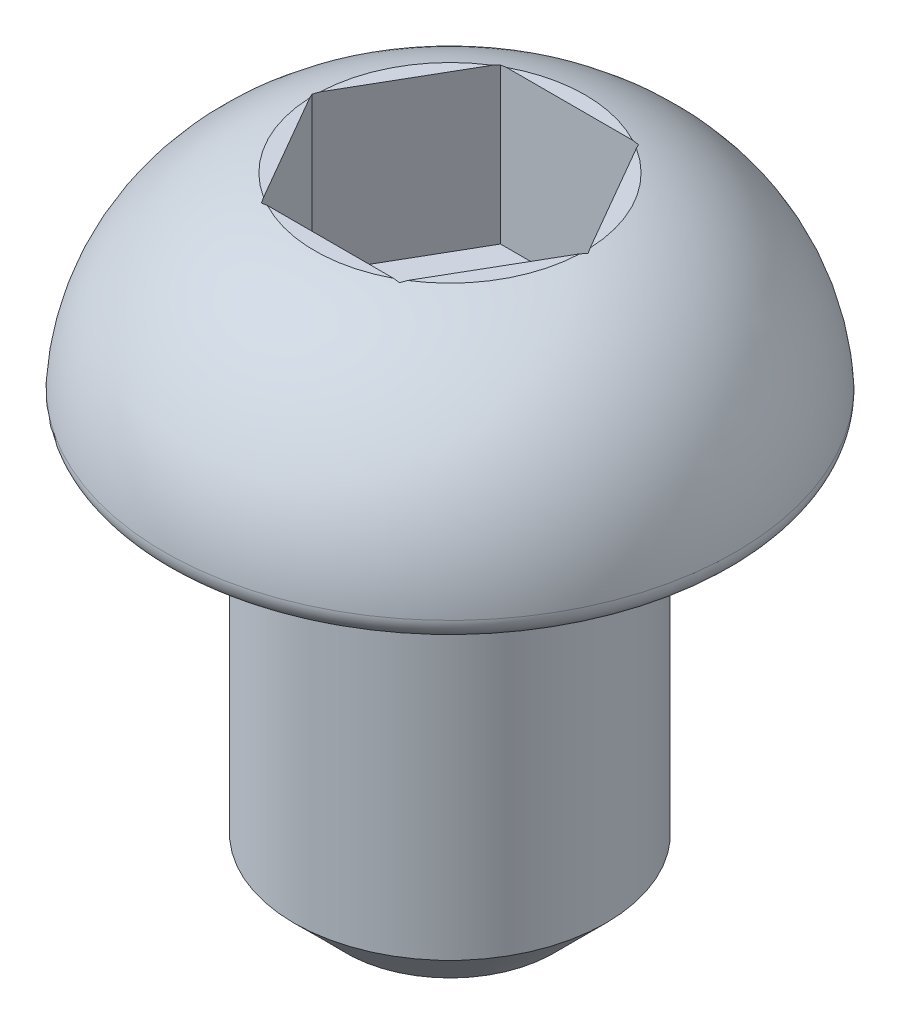
ISO-10303-21;
HEADER;
FILE_DESCRIPTION(('STEP AP214'),'2;1');
FILE_NAME('part.step','',(''),(''),'','','');
FILE_SCHEMA(('AUTOMOTIVE_DESIGN { 1 0 10303 214 1 1 1 1 }'));
ENDSEC;
DATA;
#1=APPLICATION_CONTEXT('core data for automotive mechanical design processes');
#2=APPLICATION_PROTOCOL_DEFINITION('international standard','automotive_design',2000,#1);
#3=PRODUCT_CONTEXT('',#1,'mechanical');
#4=PRODUCT('Part','Part','',(#3));
#5=PRODUCT_RELATED_PRODUCT_CATEGORY('part','',(#4));
#6=PRODUCT_DEFINITION_FORMATION('','',#4);
#7=PRODUCT_DEFINITION_CONTEXT('part definition',#1,'design');
#8=PRODUCT_DEFINITION('design','',#6,#7);
#9=PRODUCT_DEFINITION_SHAPE('','',#8);
#10=(LENGTH_UNIT() NAMED_UNIT(*) SI_UNIT(.MILLI.,.METRE.));
#11=(NAMED_UNIT(*) PLANE_ANGLE_UNIT() SI_UNIT($,.RADIAN.));
#12=(NAMED_UNIT(*) SI_UNIT($,.STERADIAN.) SOLID_ANGLE_UNIT());
#13=UNCERTAINTY_MEASURE_WITH_UNIT(LENGTH_MEASURE(1.E-05),#10,'distance_accuracy_value','');
#14=(GEOMETRIC_REPRESENTATION_CONTEXT(3) GLOBAL_UNCERTAINTY_ASSIGNED_CONTEXT((#13)) GLOBAL_UNIT_ASSIGNED_CONTEXT((#10,
#11,#12)) REPRESENTATION_CONTEXT('',''));
#15=CARTESIAN_POINT('',(0.,0.,0.));
#16=DIRECTION('',(0.,0.,1.));
#17=DIRECTION('',(1.,0.,0.));
#18=AXIS2_PLACEMENT_3D('',#15,#16,#17);
#19=CARTESIAN_POINT('',(0.,0.,0.));
#20=DIRECTION('',(0.,-1.,0.));
#21=DIRECTION('',(0.,0.,-1.));
#22=AXIS2_PLACEMENT_3D('',#19,#20,#21);
#23=PLANE('',#22);
#24=CARTESIAN_POINT('',(0.,0.,0.));
#25=DIRECTION('',(0.,-1.,0.));
#26=DIRECTION('',(0.,0.,-1.));
#27=AXIS2_PLACEMENT_3D('',#24,#25,#26);
#28=CIRCLE('',#27,2.54724235554234);
#29=CARTESIAN_POINT('',(0.,0.,-2.54724235554234));
#30=VERTEX_POINT('',#29);
#31=EDGE_CURVE('E188',#30,#30,#28,.T.);
#32=ORIENTED_EDGE('',*,*,#31,.T.);
#33=EDGE_LOOP('',(#32));
#34=FACE_BOUND('',#33,.T.);
#35=CARTESIAN_POINT('',(0.,0.,0.));
#36=DIRECTION('',(0.,-1.,0.));
#37=DIRECTION('',(0.,0.,-1.));
#38=AXIS2_PLACEMENT_3D('',#35,#36,#37);
#39=CIRCLE('',#38,1.5);
#40=CARTESIAN_POINT('',(0.,0.,-1.5));
#41=VERTEX_POINT('',#40);
#42=EDGE_CURVE('E154',#41,#41,#39,.T.);
#43=ORIENTED_EDGE('',*,*,#42,.F.);
#44=EDGE_LOOP('',(#43));
#45=FACE_BOUND('',#44,.T.);
#46=ADVANCED_FACE('F36',(#34,#45),#23,.T.);
#47=CARTESIAN_POINT('',(0.,2.,0.));
#48=DIRECTION('',(0.,1.,0.));
#49=DIRECTION('',(0.,0.,1.));
#50=AXIS2_PLACEMENT_3D('',#47,#48,#49);
#51=PLANE('',#50);
#52=DIRECTION('',(0.5,0.,-0.866025403784439));
#53=VECTOR('',#52,1.);
#54=CARTESIAN_POINT('',(0.66395280956807,2.,1.15));
#55=LINE('',#54,#53);
#56=CARTESIAN_POINT('',(0.692820323027552,2.,1.1));
#57=VERTEX_POINT('',#56);
#58=CARTESIAN_POINT('',(1.29903810567666,2.,0.0499999999999994));
#59=VERTEX_POINT('',#58);
#60=EDGE_CURVE('E163',#57,#59,#55,.T.);
#61=ORIENTED_EDGE('',*,*,#60,.F.);
#62=CARTESIAN_POINT('',(0.,2.,0.));
#63=DIRECTION('',(0.,-1.,0.));
#64=DIRECTION('',(0.,0.,-1.));
#65=AXIS2_PLACEMENT_3D('',#62,#63,#64);
#66=CIRCLE('',#65,1.3);
#67=EDGE_CURVE('E316',#59,#57,#66,.T.);
#68=ORIENTED_EDGE('',*,*,#67,.F.);
#69=EDGE_LOOP('',(#61,#68));
#70=FACE_BOUND('',#69,.T.);
#71=ADVANCED_FACE('F284',(#70),#51,.T.);
#72=DIRECTION('',(1.,0.,0.));
#73=VECTOR('',#72,1.);
#74=CARTESIAN_POINT('',(-0.66395280956807,2.,1.15));
#75=LINE('',#74,#73);
#76=CARTESIAN_POINT('',(-0.606217782649107,2.,1.15));
#77=VERTEX_POINT('',#76);
#78=CARTESIAN_POINT('',(0.606217782649107,2.,1.15));
#79=VERTEX_POINT('',#78);
#80=EDGE_CURVE('E149',#77,#79,#75,.T.);
#81=ORIENTED_EDGE('',*,*,#80,.F.);
#82=EDGE_CURVE('E318',#79,#77,#66,.T.);
#83=ORIENTED_EDGE('',*,*,#82,.F.);
#84=EDGE_LOOP('',(#81,#83));
#85=FACE_BOUND('',#84,.T.);
#86=ADVANCED_FACE('F290',(#85),#51,.T.);
#87=DIRECTION('',(0.5,0.,0.866025403784438));
#88=VECTOR('',#87,1.);
#89=CARTESIAN_POINT('',(-1.32790561913614,2.,0.));
#90=LINE('',#89,#88);
#91=CARTESIAN_POINT('',(-1.29903810567666,2.,0.0500000000000002));
#92=VERTEX_POINT('',#91);
#93=CARTESIAN_POINT('',(-0.692820323027551,2.,1.1));
#94=VERTEX_POINT('',#93);
#95=EDGE_CURVE('E151',#92,#94,#90,.T.);
#96=ORIENTED_EDGE('',*,*,#95,.F.);
#97=EDGE_CURVE('E320',#94,#92,#66,.T.);
#98=ORIENTED_EDGE('',*,*,#97,.F.);
#99=EDGE_LOOP('',(#96,#98));
#100=FACE_BOUND('',#99,.T.);
#101=ADVANCED_FACE('F344',(#100),#51,.T.);
#102=DIRECTION('',(-0.5,0.,0.866025403784439));
#103=VECTOR('',#102,1.);
#104=CARTESIAN_POINT('',(-0.66395280956807,2.,-1.15));
#105=LINE('',#104,#103);
#106=CARTESIAN_POINT('',(-0.692820323027551,2.,-1.1));
#107=VERTEX_POINT('',#106);
#108=CARTESIAN_POINT('',(-1.29903810567666,2.,-0.0500000000000003));
#109=VERTEX_POINT('',#108);
#110=EDGE_CURVE('E168',#107,#109,#105,.T.);
#111=ORIENTED_EDGE('',*,*,#110,.F.);
#112=EDGE_CURVE('E186',#109,#107,#66,.T.);
#113=ORIENTED_EDGE('',*,*,#112,.F.);
#114=EDGE_LOOP('',(#111,#113));
#115=FACE_BOUND('',#114,.T.);
#116=ADVANCED_FACE('F333',(#115),#51,.T.);
#117=DIRECTION('',(-1.,0.,0.));
#118=VECTOR('',#117,1.);
#119=CARTESIAN_POINT('',(0.663952809568069,2.,-1.15));
#120=LINE('',#119,#118);
#121=CARTESIAN_POINT('',(0.606217782649107,2.,-1.15));
#122=VERTEX_POINT('',#121);
#123=CARTESIAN_POINT('',(-0.606217782649107,2.,-1.15));
#124=VERTEX_POINT('',#123);
#125=EDGE_CURVE('E166',#122,#124,#120,.T.);
#126=ORIENTED_EDGE('',*,*,#125,.F.);
#127=EDGE_CURVE('E173',#124,#122,#66,.T.);
#128=ORIENTED_EDGE('',*,*,#127,.F.);
#129=EDGE_LOOP('',(#126,#128));
#130=FACE_BOUND('',#129,.T.);
#131=ADVANCED_FACE('F309',(#130),#51,.T.);
#132=DIRECTION('',(-0.5,0.,-0.866025403784438));
#133=VECTOR('',#132,1.);
#134=CARTESIAN_POINT('',(1.32790561913614,2.,0.));
#135=LINE('',#134,#133);
#136=CARTESIAN_POINT('',(1.29903810567666,2.,-0.0499999999999994));
#137=VERTEX_POINT('',#136);
#138=CARTESIAN_POINT('',(0.69282032302755,2.,-1.1));
#139=VERTEX_POINT('',#138);
#140=EDGE_CURVE('E51',#137,#139,#135,.T.);
#141=ORIENTED_EDGE('',*,*,#140,.F.);
#142=EDGE_CURVE('E187',#139,#137,#66,.T.);
#143=ORIENTED_EDGE('',*,*,#142,.F.);
#144=EDGE_LOOP('',(#141,#143));
#145=FACE_BOUND('',#144,.T.);
#146=ADVANCED_FACE('F292',(#145),#51,.T.);
#147=CARTESIAN_POINT('',(0.,0.076691427643514,0.));
#148=DIRECTION('',(0.,-1.,0.));
#149=DIRECTION('',(0.,0.,-1.));
#150=AXIS2_PLACEMENT_3D('',#147,#148,#149);
#151=DEGENERATE_TOROIDAL_SURFACE('',#150,0.751470934680709,2.,.T.);
#152=CARTESIAN_POINT('',(0.663837339514232,1.99178669993929,1.1502));
#153=CARTESIAN_POINT('',(0.66878717333089,1.99327644137946,1.14162663634053));
#154=CARTESIAN_POINT('',(0.673740102582228,1.99472242054365,1.13304791123091));
#155=CARTESIAN_POINT('',(0.683652150360132,1.99752685386907,1.11587974087253));
#156=CARTESIAN_POINT('',(0.688611268884708,1.99888530805844,1.10729029562721));
#157=CARTESIAN_POINT('',(0.693573482841972,2.0002,1.0986954889352));
#158=B_SPLINE_CURVE_WITH_KNOTS('',3,(#152,#153,#154,#155,#156,#157),.UNSPECIFIED.,.F.,.F.,(4,2,
4),(0.,0.0300325156416312,0.0600650216231519),.UNSPECIFIED.);
#159=CARTESIAN_POINT('',(0.66395280956807,1.99182146358279,1.15));
#160=VERTEX_POINT('',#159);
#161=EDGE_CURVE('E266',#160,#57,#158,.T.);
#162=ORIENTED_EDGE('',*,*,#161,.F.);
#163=CARTESIAN_POINT('',(0.,2.03658290017349,1.15));
#164=CARTESIAN_POINT('',(0.098646218600147,2.03658732143362,1.15));
#165=CARTESIAN_POINT('',(0.197295101956486,2.03408796152423,1.15));
#166=CARTESIAN_POINT('',(0.394304837949951,2.02310682474313,1.15));
#167=CARTESIAN_POINT('',(0.492665658489158,2.01462440489486,1.15));
#168=CARTESIAN_POINT('',(0.687609728686378,1.98957726871187,1.15));
#169=CARTESIAN_POINT('',(0.784200929312974,1.97307885273518,1.15));
#170=CARTESIAN_POINT('',(0.975057818596466,1.93000622100407,1.15));
#171=CARTESIAN_POINT('',(1.06932598789786,1.90344329758489,1.15));
#172=CARTESIAN_POINT('',(1.27000942224647,1.83324426296719,1.15));
#173=CARTESIAN_POINT('',(1.37568972004873,1.78744372549576,1.15));
#174=CARTESIAN_POINT('',(1.57845042818664,1.67924757225634,1.15));
#175=CARTESIAN_POINT('',(1.67551966120083,1.61683079666585,1.15));
#176=CARTESIAN_POINT('',(1.8578430964694,1.47582375887711,1.15));
#177=CARTESIAN_POINT('',(1.94304549944359,1.39716609459964,1.15));
#178=CARTESIAN_POINT('',(2.09784101718846,1.22574174763031,1.15));
#179=CARTESIAN_POINT('',(2.16743940990664,1.13297985346576,1.15));
#180=CARTESIAN_POINT('',(2.28431419983866,0.94263887552125,1.15));
#181=CARTESIAN_POINT('',(2.33275383814089,0.845772961604736,1.15));
#182=CARTESIAN_POINT('',(2.41188684890319,0.645049587695764,1.15));
#183=CARTESIAN_POINT('',(2.44258507109003,0.541194047036149,1.15));
#184=CARTESIAN_POINT('',(2.48427081779776,0.334046404725987,1.15));
#185=CARTESIAN_POINT('',(2.49601517014892,0.230905918770504,1.15));
#186=CARTESIAN_POINT('',(2.50179966751879,0.0241281883602649,1.15));
#187=CARTESIAN_POINT('',(2.49584075628937,-0.0795090293199227,1.15));
#188=CARTESIAN_POINT('',(2.46658780707738,-0.283077440217687,1.15));
#189=CARTESIAN_POINT('',(2.44349452160948,-0.383037592772008,1.15));
#190=CARTESIAN_POINT('',(2.38096161026423,-0.577676291567684,1.15));
#191=CARTESIAN_POINT('',(2.34152541798826,-0.672355942490544,1.15));
#192=CARTESIAN_POINT('',(2.24727327907491,-0.854473591721951,1.15));
#193=CARTESIAN_POINT('',(2.19236137755517,-0.941861853863798,1.15));
#194=CARTESIAN_POINT('',(2.06898309304621,-1.10654284237712,1.15));
#195=CARTESIAN_POINT('',(2.00050758110401,-1.18382871088677,1.15));
#196=CARTESIAN_POINT('',(1.85001098526993,-1.32858936571327,1.15));
#197=CARTESIAN_POINT('',(1.76765450591879,-1.3957143916501,1.15));
#198=CARTESIAN_POINT('',(1.59361449911652,-1.51612024156412,1.15));
#199=CARTESIAN_POINT('',(1.50194689329583,-1.56942416234802,1.15));
#200=CARTESIAN_POINT('',(1.3442167468046,-1.64633505265362,1.15));
#201=CARTESIAN_POINT('',(1.28002488900966,-1.67388067349761,1.15));
#202=CARTESIAN_POINT('',(1.14942569560088,-1.72309655156327,1.15));
#203=CARTESIAN_POINT('',(1.08301829059227,-1.74476662455823,1.15));
#204=CARTESIAN_POINT('',(0.948299721594118,-1.78271208504272,1.15));
#205=CARTESIAN_POINT('',(0.879979992399287,-1.79895664735316,1.15));
#206=CARTESIAN_POINT('',(0.742372225887791,-1.82648676897236,1.15));
#207=CARTESIAN_POINT('',(0.673084213384437,-1.83777245511816,1.15));
#208=CARTESIAN_POINT('',(0.491428640373657,-1.8618030535964,1.15));
#209=CARTESIAN_POINT('',(0.378625107961637,-1.87122074908676,1.15));
#210=CARTESIAN_POINT('',(0.209143758579499,-1.87958699044929,1.15));
#211=CARTESIAN_POINT('',(0.152562345228347,-1.88141490888953,1.15));
#212=CARTESIAN_POINT('',(0.0393669602172776,-1.88335114487218,1.15));
#213=CARTESIAN_POINT('',(-0.0172470100143041,-1.883459532838,1.15));
#214=CARTESIAN_POINT('',(-0.130350030932136,-1.88197557574409,1.15));
#215=CARTESIAN_POINT('',(-0.186839119823327,-1.88038635915171,1.15));
#216=CARTESIAN_POINT('',(-0.299728920798325,-1.87531771771226,1.15));
#217=CARTESIAN_POINT('',(-0.356129628836693,-1.87183820873768,1.15));
#218=CARTESIAN_POINT('',(-0.524916952582429,-1.85805049067533,1.15));
#219=CARTESIAN_POINT('',(-0.637092371817397,-1.84439266677423,1.15));
#220=CARTESIAN_POINT('',(-0.810017493876797,-1.81361696288777,1.15));
#221=CARTESIAN_POINT('',(-0.871521077506692,-1.80071656706703,1.15));
#222=CARTESIAN_POINT('',(-0.993496408589721,-1.77064052799502,1.15));
#223=CARTESIAN_POINT('',(-1.05396806098029,-1.75346449311514,1.15));
#224=CARTESIAN_POINT('',(-1.17323439190626,-1.71454198802947,1.15));
#225=CARTESIAN_POINT('',(-1.2320335047974,-1.69280919801169,1.15));
#226=CARTESIAN_POINT('',(-1.34764514507638,-1.64452542038476,1.15));
#227=CARTESIAN_POINT('',(-1.40445721463237,-1.61797333097724,1.15));
#228=CARTESIAN_POINT('',(-1.51607405614635,-1.55969669663654,1.15));
#229=CARTESIAN_POINT('',(-1.57085410804412,-1.52792462132762,1.15));
#230=CARTESIAN_POINT('',(-1.67726545993891,-1.45943403628238,1.15));
#231=CARTESIAN_POINT('',(-1.72889554802264,-1.42271363995312,1.15));
#232=CARTESIAN_POINT('',(-1.82847105838098,-1.34445894230347,1.15));
#233=CARTESIAN_POINT('',(-1.87641252573548,-1.30291959053453,1.15));
#234=CARTESIAN_POINT('',(-1.9680035552563,-1.21534492943057,1.15));
#235=CARTESIAN_POINT('',(-2.01165174969555,-1.16930819659477,1.15));
#236=CARTESIAN_POINT('',(-2.12614975655006,-1.03572622565891,1.15));
#237=CARTESIAN_POINT('',(-2.19186050387076,-0.943665750390142,1.15));
#238=CARTESIAN_POINT('',(-2.30546191326039,-0.749288259753581,1.15));
#239=CARTESIAN_POINT('',(-2.35337031200657,-0.646981582540756,1.15));
#240=CARTESIAN_POINT('',(-2.42703869947872,-0.442585671523526,1.15));
#241=CARTESIAN_POINT('',(-2.45409068083514,-0.340961259178402,1.15));
#242=CARTESIAN_POINT('',(-2.49032992545249,-0.134567326214733,1.15));
#243=CARTESIAN_POINT('',(-2.49951787124879,-0.0297979259127926,1.15));
#244=CARTESIAN_POINT('',(-2.49971519023315,0.177457556639515,1.15));
#245=CARTESIAN_POINT('',(-2.49111740474565,0.279943506757529,1.15));
#246=CARTESIAN_POINT('',(-2.45681698932696,0.482000924000085,1.15));
#247=CARTESIAN_POINT('',(-2.43111591392285,0.581572655140941,1.15));
#248=CARTESIAN_POINT('',(-2.36347334234934,0.774935615001325,1.15));
#249=CARTESIAN_POINT('',(-2.32154526289618,0.868731545166596,1.15));
#250=CARTESIAN_POINT('',(-2.22279701257776,1.04811167401887,1.15));
#251=CARTESIAN_POINT('',(-2.16597630912103,1.13369557887707,1.15));
#252=CARTESIAN_POINT('',(-2.03810854833738,1.29594922041055,1.15));
#253=CARTESIAN_POINT('',(-1.96682676359936,1.37243365695663,1.15));
#254=CARTESIAN_POINT('',(-1.81295905623226,1.51300240336353,1.15));
#255=CARTESIAN_POINT('',(-1.73037090646585,1.57708426413665,1.15));
#256=CARTESIAN_POINT('',(-1.5520613820707,1.69471516717586,1.15));
#257=CARTESIAN_POINT('',(-1.45589046579648,1.74757961403836,1.15));
#258=CARTESIAN_POINT('',(-1.25692243260643,1.83837035879711,1.15));
#259=CARTESIAN_POINT('',(-1.15413109373742,1.87630948273586,1.15));
#260=CARTESIAN_POINT('',(-0.964938329481516,1.93242013134816,1.15));
#261=CARTESIAN_POINT('',(-0.879225780531216,1.95299866436732,1.15));
#262=CARTESIAN_POINT('',(-0.706280939870257,1.98646029403696,1.15));
#263=CARTESIAN_POINT('',(-0.6190475593282,1.9993376228744,1.15));
#264=CARTESIAN_POINT('',(-0.443289273005161,2.01901301040914,1.15));
#265=CARTESIAN_POINT('',(-0.354759586940948,2.02576557714995,1.15));
#266=CARTESIAN_POINT('',(-0.17748732142704,2.03454856601354,1.15));
#267=CARTESIAN_POINT('',(-0.0887447390438819,2.03657892269132,1.15));
#268=CARTESIAN_POINT('',(0.,2.03658290017349,1.15));
#269=B_SPLINE_CURVE_WITH_KNOTS('',3,(#163,#164,#165,#166,#167,#168,#169,#170,#171,#172,#173,
#174,#175,#176,#177,#178,#179,#180,#181,#182,#183,#184,#185,#186,#187,#188,#189,#190,#191,#192,
#193,#194,#195,#196,#197,#198,#199,#200,#201,#202,#203,#204,#205,#206,#207,#208,#209,#210,#211,
#212,#213,#214,#215,#216,#217,#218,#219,#220,#221,#222,#223,#224,#225,#226,#227,#228,#229,#230,
#231,#232,#233,#234,#235,#236,#237,#238,#239,#240,#241,#242,#243,#244,#245,#246,#247,#248,#249,
#250,#251,#252,#253,#254,#255,#256,#257,#258,#259,#260,#261,#262,#263,#264,#265,#266,#267,#268),
.UNSPECIFIED.,.T.,.F.,(4,2,2,2,2,2,2,2,2,2,2,2,2,2,2,2,2,2,2,2,2,2,2,2,2,2,2,2,2,2,2,2,2,2,2,2,
2,2,2,2,2,2,2,2,2,2,2,2,2,2,2,2,4),(0.,0.295902440396797,0.591836685142885,0.88536388192649,
1.1785627130153,1.52269996813138,1.86727757612131,2.21331506104864,2.5592353240376,
2.88250449229488,3.2056852510601,3.51561009227793,3.82551841185847,4.13185195746594,
4.43812117581053,4.74633280791623,5.05475259026988,5.37212175852073,5.68895709402482,
5.89824437929793,6.10753822597639,6.31800171851667,6.52845982755554,6.86760372007158,
7.03742508416335,7.20723949320035,7.37674149510497,7.54625104131724,7.8846605033158,
8.07306010337971,8.26147696632307,8.44933606655962,8.63723816976182,8.82695710833894,
9.01674858473973,9.20674079803173,9.39679334327464,9.73415597564318,10.0711815829047,
10.3851290507443,10.6990645232839,11.0061400458043,11.3131876618792,11.6199819471461,
11.9267872055172,12.2390410643218,12.5513565198947,12.8792462443636,13.2068535787986,
13.4709069754266,13.7351578878529,14.0013558354432,14.267557472243),.UNSPECIFIED.);
#270=EDGE_CURVE('E59',#79,#160,#269,.T.);
#271=ORIENTED_EDGE('',*,*,#270,.F.);
#272=ORIENTED_EDGE('',*,*,#82,.T.);
#273=CARTESIAN_POINT('',(-0.66395280956807,1.99182146358212,1.15));
#274=VERTEX_POINT('',#273);
#275=EDGE_CURVE('E262',#274,#77,#269,.T.);
#276=ORIENTED_EDGE('',*,*,#275,.F.);
#277=CARTESIAN_POINT('',(-0.693573482841972,2.0002,1.0986954889352));
#278=CARTESIAN_POINT('',(-0.688611268884708,1.99888530805844,1.10729029562721));
#279=CARTESIAN_POINT('',(-0.683652150360132,1.99752685386907,1.11587974087253));
#280=CARTESIAN_POINT('',(-0.673740102582228,1.99472242054365,1.13304791123091));
#281=CARTESIAN_POINT('',(-0.66878717333089,1.99327644137946,1.14162663634053));
#282=CARTESIAN_POINT('',(-0.663837339514232,1.99178669993929,1.1502));
#283=B_SPLINE_CURVE_WITH_KNOTS('',3,(#277,#278,#279,#280,#281,#282),.UNSPECIFIED.,.F.,.F.,(4,2,
4),(0.,0.0300325059815209,0.0600650216231522),.UNSPECIFIED.);
#284=EDGE_CURVE('E257',#94,#274,#283,.T.);
#285=ORIENTED_EDGE('',*,*,#284,.F.);
#286=ORIENTED_EDGE('',*,*,#97,.T.);
#287=CARTESIAN_POINT('',(-1.32802108918998,1.99178669993929,-0.000199999999999881));
#288=CARTESIAN_POINT('',(-1.32307125537332,1.99327644137946,0.00837336365947469));
#289=CARTESIAN_POINT('',(-1.31811832612198,1.99472242054365,0.0169520887690861));
#290=CARTESIAN_POINT('',(-1.30820627834408,1.99752685386907,0.0341202591274678));
#291=CARTESIAN_POINT('',(-1.3032471598195,1.99888530805844,0.0427097043727891));
#292=CARTESIAN_POINT('',(-1.29828494586224,2.0002,0.0513045110647981));
#293=B_SPLINE_CURVE_WITH_KNOTS('',3,(#287,#288,#289,#290,#291,#292),.UNSPECIFIED.,.F.,.F.,(4,2,
4),(0.,0.030032515641632,0.0600650216231535),.UNSPECIFIED.);
#294=CARTESIAN_POINT('',(-1.32790561913614,1.99182146358212,0.));
#295=VERTEX_POINT('',#294);
#296=EDGE_CURVE('E252',#295,#92,#293,.T.);
#297=ORIENTED_EDGE('',*,*,#296,.F.);
#298=CARTESIAN_POINT('',(-1.29828494586224,2.0002,-0.0513045110647978));
#299=CARTESIAN_POINT('',(-1.3032471598195,1.99888530805844,-0.0427097043727888));
#300=CARTESIAN_POINT('',(-1.30820627834408,1.99752685386907,-0.0341202591274676));
#301=CARTESIAN_POINT('',(-1.31811832612198,1.99472242054365,-0.016952088769086));
#302=CARTESIAN_POINT('',(-1.32307125537332,1.99327644137946,-0.00837336365947457));
#303=CARTESIAN_POINT('',(-1.32802108918998,1.99178669993929,0.000199999999999972));
#304=B_SPLINE_CURVE_WITH_KNOTS('',3,(#298,#299,#300,#301,#302,#303),.UNSPECIFIED.,.F.,.F.,(4,2,
4),(0.,0.0300325059815215,0.0600650216231534),.UNSPECIFIED.);
#305=EDGE_CURVE('E232',#109,#295,#304,.T.);
#306=ORIENTED_EDGE('',*,*,#305,.F.);
#307=ORIENTED_EDGE('',*,*,#112,.T.);
#308=CARTESIAN_POINT('',(-0.663837339514232,1.99178669993929,-1.1502));
#309=CARTESIAN_POINT('',(-0.66878717333089,1.99327644137946,-1.14162663634053));
#310=CARTESIAN_POINT('',(-0.673740102582228,1.99472242054365,-1.13304791123091));
#311=CARTESIAN_POINT('',(-0.683652150360133,1.99752685386907,-1.11587974087253));
#312=CARTESIAN_POINT('',(-0.688611268884709,1.99888530805844,-1.10729029562721));
#313=CARTESIAN_POINT('',(-0.693573482841973,2.0002,-1.0986954889352));
#314=B_SPLINE_CURVE_WITH_KNOTS('',3,(#308,#309,#310,#311,#312,#313),.UNSPECIFIED.,.F.,.F.,(4,2,
4),(0.,0.0300325156416316,0.0600650216231527),.UNSPECIFIED.);
#315=CARTESIAN_POINT('',(-0.66395280956807,1.99182146358279,-1.15));
#316=VERTEX_POINT('',#315);
#317=EDGE_CURVE('E227',#316,#107,#314,.T.);
#318=ORIENTED_EDGE('',*,*,#317,.F.);
#319=CARTESIAN_POINT('',(0.,2.03658290017349,-1.15));
#320=CARTESIAN_POINT('',(-0.0986462186001475,2.03658732143362,-1.15));
#321=CARTESIAN_POINT('',(-0.197295101956487,2.03408796152423,-1.15));
#322=CARTESIAN_POINT('',(-0.394304837949951,2.02310682474313,-1.15));
#323=CARTESIAN_POINT('',(-0.492665658489158,2.01462440489486,-1.15));
#324=CARTESIAN_POINT('',(-0.687609728686379,1.98957726871187,-1.15));
#325=CARTESIAN_POINT('',(-0.784200929312975,1.97307885273518,-1.15));
#326=CARTESIAN_POINT('',(-0.975057818596467,1.93000622100407,-1.15));
#327=CARTESIAN_POINT('',(-1.06932598789786,1.90344329758489,-1.15));
#328=CARTESIAN_POINT('',(-1.27000942224647,1.83324426296719,-1.15));
#329=CARTESIAN_POINT('',(-1.37568972004873,1.78744372549576,-1.15));
#330=CARTESIAN_POINT('',(-1.57845042818664,1.67924757225634,-1.15));
#331=CARTESIAN_POINT('',(-1.67551966120083,1.61683079666585,-1.15));
#332=CARTESIAN_POINT('',(-1.8578430964694,1.47582375887711,-1.15));
#333=CARTESIAN_POINT('',(-1.94304549944359,1.39716609459964,-1.15));
#334=CARTESIAN_POINT('',(-2.09784101718846,1.22574174763031,-1.15));
#335=CARTESIAN_POINT('',(-2.16743940990664,1.13297985346576,-1.15));
#336=CARTESIAN_POINT('',(-2.28431419983867,0.942638875521249,-1.15));
#337=CARTESIAN_POINT('',(-2.33275383814089,0.845772961604735,-1.15));
#338=CARTESIAN_POINT('',(-2.41188684890319,0.645049587695763,-1.15));
#339=CARTESIAN_POINT('',(-2.44258507109003,0.541194047036148,-1.15));
#340=CARTESIAN_POINT('',(-2.48427081779776,0.334046404725987,-1.15));
#341=CARTESIAN_POINT('',(-2.49601517014892,0.230905918770504,-1.15));
#342=CARTESIAN_POINT('',(-2.50179966751879,0.0241281883602644,-1.15));
#343=CARTESIAN_POINT('',(-2.49584075628937,-0.0795090293199232,-1.15));
#344=CARTESIAN_POINT('',(-2.46658780707738,-0.283077440217688,-1.15));
#345=CARTESIAN_POINT('',(-2.44349452160948,-0.383037592772009,-1.15));
#346=CARTESIAN_POINT('',(-2.38096161026423,-0.577676291567685,-1.15));
#347=CARTESIAN_POINT('',(-2.34152541798826,-0.672355942490545,-1.15));
#348=CARTESIAN_POINT('',(-2.24727327907491,-0.854473591721952,-1.15));
#349=CARTESIAN_POINT('',(-2.19236137755517,-0.941861853863799,-1.15));
#350=CARTESIAN_POINT('',(-2.06898309304621,-1.10654284237712,-1.15));
#351=CARTESIAN_POINT('',(-2.00050758110401,-1.18382871088677,-1.15));
#352=CARTESIAN_POINT('',(-1.85001098526993,-1.32858936571327,-1.15));
#353=CARTESIAN_POINT('',(-1.76765450591879,-1.3957143916501,-1.15));
#354=CARTESIAN_POINT('',(-1.59361449911652,-1.51612024156412,-1.15));
#355=CARTESIAN_POINT('',(-1.50194689329583,-1.56942416234802,-1.15));
#356=CARTESIAN_POINT('',(-1.3442167468046,-1.64633505265362,-1.15));
#357=CARTESIAN_POINT('',(-1.28002488900966,-1.67388067349761,-1.15));
#358=CARTESIAN_POINT('',(-1.14942569560088,-1.72309655156327,-1.15));
#359=CARTESIAN_POINT('',(-1.08301829059227,-1.74476662455823,-1.15));
#360=CARTESIAN_POINT('',(-0.948299721594117,-1.78271208504273,-1.15));
#361=CARTESIAN_POINT('',(-0.879979992399286,-1.79895664735316,-1.15));
#362=CARTESIAN_POINT('',(-0.74237222588779,-1.82648676897236,-1.15));
#363=CARTESIAN_POINT('',(-0.673084213384436,-1.83777245511816,-1.15));
#364=CARTESIAN_POINT('',(-0.491428640373656,-1.8618030535964,-1.15));
#365=CARTESIAN_POINT('',(-0.378625107961636,-1.87122074908676,-1.15));
#366=CARTESIAN_POINT('',(-0.209143758579498,-1.87958699044929,-1.15));
#367=CARTESIAN_POINT('',(-0.152562345228346,-1.88141490888953,-1.15));
#368=CARTESIAN_POINT('',(-0.0393669602172767,-1.88335114487218,-1.15));
#369=CARTESIAN_POINT('',(0.0172470100143049,-1.883459532838,-1.15));
#370=CARTESIAN_POINT('',(0.130350030932137,-1.88197557574409,-1.15));
#371=CARTESIAN_POINT('',(0.186839119823328,-1.88038635915171,-1.15));
#372=CARTESIAN_POINT('',(0.299728920798326,-1.87531771771226,-1.15));
#373=CARTESIAN_POINT('',(0.356129628836694,-1.87183820873768,-1.15));
#374=CARTESIAN_POINT('',(0.524916952582429,-1.85805049067533,-1.15));
#375=CARTESIAN_POINT('',(0.637092371817398,-1.84439266677423,-1.15));
#376=CARTESIAN_POINT('',(0.810017493876798,-1.81361696288777,-1.15));
#377=CARTESIAN_POINT('',(0.871521077506693,-1.80071656706703,-1.15));
#378=CARTESIAN_POINT('',(0.993496408589723,-1.77064052799502,-1.15));
#379=CARTESIAN_POINT('',(1.05396806098029,-1.75346449311514,-1.15));
#380=CARTESIAN_POINT('',(1.17323439190626,-1.71454198802947,-1.15));
#381=CARTESIAN_POINT('',(1.2320335047974,-1.69280919801169,-1.15));
#382=CARTESIAN_POINT('',(1.34764514507638,-1.64452542038476,-1.15));
#383=CARTESIAN_POINT('',(1.40445721463237,-1.61797333097724,-1.15));
#384=CARTESIAN_POINT('',(1.51607405614635,-1.55969669663654,-1.15));
#385=CARTESIAN_POINT('',(1.57085410804412,-1.52792462132762,-1.15));
#386=CARTESIAN_POINT('',(1.67726545993891,-1.45943403628238,-1.15));
#387=CARTESIAN_POINT('',(1.72889554802264,-1.42271363995312,-1.15));
#388=CARTESIAN_POINT('',(1.82847105838098,-1.34445894230347,-1.15));
#389=CARTESIAN_POINT('',(1.87641252573548,-1.30291959053453,-1.15));
#390=CARTESIAN_POINT('',(1.9680035552563,-1.21534492943057,-1.15));
#391=CARTESIAN_POINT('',(2.01165174969555,-1.16930819659477,-1.15));
#392=CARTESIAN_POINT('',(2.12614975655006,-1.03572622565891,-1.15));
#393=CARTESIAN_POINT('',(2.19186050387076,-0.943665750390142,-1.15));
#394=CARTESIAN_POINT('',(2.30546191326039,-0.749288259753581,-1.15));
#395=CARTESIAN_POINT('',(2.35337031200657,-0.646981582540756,-1.15));
#396=CARTESIAN_POINT('',(2.42703869947872,-0.442585671523526,-1.15));
#397=CARTESIAN_POINT('',(2.45409068083514,-0.340961259178402,-1.15));
#398=CARTESIAN_POINT('',(2.49032992545249,-0.134567326214733,-1.15));
#399=CARTESIAN_POINT('',(2.49951787124879,-0.0297979259127928,-1.15));
#400=CARTESIAN_POINT('',(2.49971519023315,0.177457556639515,-1.15));
#401=CARTESIAN_POINT('',(2.49111740474565,0.279943506757529,-1.15));
#402=CARTESIAN_POINT('',(2.45681698932696,0.482000924000085,-1.15));
#403=CARTESIAN_POINT('',(2.43111591392285,0.581572655140941,-1.15));
#404=CARTESIAN_POINT('',(2.36347334234934,0.774935615001325,-1.15));
#405=CARTESIAN_POINT('',(2.32154526289618,0.868731545166596,-1.15));
#406=CARTESIAN_POINT('',(2.22279701257776,1.04811167401887,-1.15));
#407=CARTESIAN_POINT('',(2.16597630912103,1.13369557887707,-1.15));
#408=CARTESIAN_POINT('',(2.03810854833738,1.29594922041055,-1.15));
#409=CARTESIAN_POINT('',(1.96682676359936,1.37243365695663,-1.15));
#410=CARTESIAN_POINT('',(1.81295905623226,1.51300240336353,-1.15));
#411=CARTESIAN_POINT('',(1.73037090646585,1.57708426413665,-1.15));
#412=CARTESIAN_POINT('',(1.5520613820707,1.69471516717586,-1.15));
#413=CARTESIAN_POINT('',(1.45589046579648,1.74757961403836,-1.15));
#414=CARTESIAN_POINT('',(1.25692243260643,1.83837035879711,-1.15));
#415=CARTESIAN_POINT('',(1.15413109373742,1.87630948273586,-1.15));
#416=CARTESIAN_POINT('',(0.964938329481515,1.93242013134816,-1.15));
#417=CARTESIAN_POINT('',(0.879225780531215,1.95299866436732,-1.15));
#418=CARTESIAN_POINT('',(0.706280939870256,1.98646029403696,-1.15));
#419=CARTESIAN_POINT('',(0.619047559328199,1.9993376228744,-1.15));
#420=CARTESIAN_POINT('',(0.44328927300516,2.01901301040914,-1.15));
#421=CARTESIAN_POINT('',(0.354759586940947,2.02576557714995,-1.15));
#422=CARTESIAN_POINT('',(0.17748732142704,2.03454856601354,-1.15));
#423=CARTESIAN_POINT('',(0.0887447390438815,2.03657892269132,-1.15));
#424=CARTESIAN_POINT('',(0.,2.03658290017349,-1.15));
#425=B_SPLINE_CURVE_WITH_KNOTS('',3,(#319,#320,#321,#322,#323,#324,#325,#326,#327,#328,#329,
#330,#331,#332,#333,#334,#335,#336,#337,#338,#339,#340,#341,#342,#343,#344,#345,#346,#347,#348,
#349,#350,#351,#352,#353,#354,#355,#356,#357,#358,#359,#360,#361,#362,#363,#364,#365,#366,#367,
#368,#369,#370,#371,#372,#373,#374,#375,#376,#377,#378,#379,#380,#381,#382,#383,#384,#385,#386,
#387,#388,#389,#390,#391,#392,#393,#394,#395,#396,#397,#398,#399,#400,#401,#402,#403,#404,#405,
#406,#407,#408,#409,#410,#411,#412,#413,#414,#415,#416,#417,#418,#419,#420,#421,#422,#423,#424),
.UNSPECIFIED.,.T.,.F.,(4,2,2,2,2,2,2,2,2,2,2,2,2,2,2,2,2,2,2,2,2,2,2,2,2,2,2,2,2,2,2,2,2,2,2,2,
2,2,2,2,2,2,2,2,2,2,2,2,2,2,2,2,4),(0.,0.295902440396797,0.591836685142885,0.88536388192649,
1.1785627130153,1.52269996813138,1.86727757612131,2.21331506104864,2.5592353240376,
2.88250449229488,3.2056852510601,3.51561009227793,3.82551841185847,4.13185195746594,
4.43812117581053,4.74633280791623,5.05475259026988,5.37212175852073,5.68895709402482,
5.89824437929793,6.10753822597639,6.31800171851667,6.52845982755554,6.86760372007158,
7.03742508416334,7.20723949320035,7.37674149510497,7.54625104131724,7.8846605033158,
8.07306010337971,8.26147696632306,8.44933606655962,8.63723816976182,8.82695710833893,
9.01674858473973,9.20674079803173,9.39679334327464,9.73415597564318,10.0711815829047,
10.3851290507443,10.6990645232839,11.0061400458043,11.3131876618792,11.6199819471461,
11.9267872055172,12.2390410643218,12.5513565198947,12.8792462443636,13.2068535787986,
13.4709069754266,13.7351578878529,14.0013558354432,14.2675574722429),.UNSPECIFIED.);
#426=EDGE_CURVE('E226',#124,#316,#425,.T.);
#427=ORIENTED_EDGE('',*,*,#426,.F.);
#428=ORIENTED_EDGE('',*,*,#127,.T.);
#429=CARTESIAN_POINT('',(0.663952809568069,1.99182146358212,-1.15));
#430=VERTEX_POINT('',#429);
#431=EDGE_CURVE('E201',#430,#122,#425,.T.);
#432=ORIENTED_EDGE('',*,*,#431,.F.);
#433=CARTESIAN_POINT('',(0.693573482841971,2.0002,-1.0986954889352));
#434=CARTESIAN_POINT('',(0.688611268884707,1.99888530805844,-1.10729029562721));
#435=CARTESIAN_POINT('',(0.683652150360131,1.99752685386907,-1.11587974087253));
#436=CARTESIAN_POINT('',(0.673740102582227,1.99472242054365,-1.13304791123091));
#437=CARTESIAN_POINT('',(0.668787173330889,1.99327644137946,-1.14162663634053));
#438=CARTESIAN_POINT('',(0.663837339514231,1.99178669993929,-1.1502));
#439=B_SPLINE_CURVE_WITH_KNOTS('',3,(#433,#434,#435,#436,#437,#438),.UNSPECIFIED.,.F.,.F.,(4,2,
4),(0.,0.0300325059815199,0.0600650216231502),.UNSPECIFIED.);
#440=EDGE_CURVE('E194',#139,#430,#439,.T.);
#441=ORIENTED_EDGE('',*,*,#440,.F.);
#442=ORIENTED_EDGE('',*,*,#142,.T.);
#443=CARTESIAN_POINT('',(1.32802108918998,1.99178669993929,0.000199999999999741));
#444=CARTESIAN_POINT('',(1.32307125537332,1.99327644137946,-0.00837336365947432));
#445=CARTESIAN_POINT('',(1.31811832612198,1.99472242054365,-0.0169520887690852));
#446=CARTESIAN_POINT('',(1.30820627834408,1.99752685386907,-0.034120259127466));
#447=CARTESIAN_POINT('',(1.3032471598195,1.99888530805844,-0.0427097043727867));
#448=CARTESIAN_POINT('',(1.29828494586224,2.0002,-0.0513045110647953));
#449=B_SPLINE_CURVE_WITH_KNOTS('',3,(#443,#444,#445,#446,#447,#448),.UNSPECIFIED.,.F.,.F.,(4,2,
4),(0.,0.0300325156416303,0.0600650216231501),.UNSPECIFIED.);
#450=CARTESIAN_POINT('',(1.32790561913614,1.99182146358279,0.));
#451=VERTEX_POINT('',#450);
#452=EDGE_CURVE('E217',#451,#137,#449,.T.);
#453=ORIENTED_EDGE('',*,*,#452,.F.);
#454=CARTESIAN_POINT('',(1.29828494586224,2.0002,0.0513045110647961));
#455=CARTESIAN_POINT('',(1.3032471598195,1.99888530805844,0.0427097043727873));
#456=CARTESIAN_POINT('',(1.30820627834408,1.99752685386907,0.0341202591274664));
#457=CARTESIAN_POINT('',(1.31811832612198,1.99472242054365,0.0169520887690852));
#458=CARTESIAN_POINT('',(1.32307125537332,1.99327644137946,0.00837336365947403));
#459=CARTESIAN_POINT('',(1.32802108918998,1.99178669993929,-0.00020000000000029));
#460=B_SPLINE_CURVE_WITH_KNOTS('',3,(#454,#455,#456,#457,#458,#459),.UNSPECIFIED.,.F.,.F.,(4,2,
4),(0.,0.0300325059815206,0.0600650216231517),.UNSPECIFIED.);
#461=EDGE_CURVE('E132',#59,#451,#460,.T.);
#462=ORIENTED_EDGE('',*,*,#461,.F.);
#463=ORIENTED_EDGE('',*,*,#67,.T.);
#464=EDGE_LOOP('',(#162,#271,#272,#276,#285,#286,#297,#306,#307,#318,#427,#428,#432,#441,#442,
#453,#462,#463));
#465=FACE_BOUND('',#464,.T.);
#466=CARTESIAN_POINT('',(0.,0.213700952484054,0.));
#467=DIRECTION('',(0.,-1.,0.));
#468=DIRECTION('',(0.,0.,-1.));
#469=AXIS2_PLACEMENT_3D('',#466,#467,#468);
#470=CIRCLE('',#469,2.74677251341586);
#471=CARTESIAN_POINT('',(0.,0.213700952484054,-2.74677251341586));
#472=VERTEX_POINT('',#471);
#473=EDGE_CURVE('E191',#472,#472,#470,.F.);
#474=ORIENTED_EDGE('',*,*,#473,.T.);
#475=EDGE_LOOP('',(#474));
#476=FACE_BOUND('',#475,.T.);
#477=ADVANCED_FACE('F206',(#465,#476),#151,.T.);
#478=CARTESIAN_POINT('',(0.,0.2,0.));
#479=DIRECTION('',(0.,-1.,0.));
#480=DIRECTION('',(0.,0.,-1.));
#481=AXIS2_PLACEMENT_3D('',#478,#479,#480);
#482=TOROIDAL_SURFACE('',#481,2.54724235554234,0.2);
#483=ORIENTED_EDGE('',*,*,#473,.F.);
#484=EDGE_LOOP('',(#483));
#485=FACE_BOUND('',#484,.T.);
#486=ORIENTED_EDGE('',*,*,#31,.F.);
#487=EDGE_LOOP('',(#486));
#488=FACE_BOUND('',#487,.T.);
#489=ADVANCED_FACE('F294',(#485,#488),#482,.T.);
#490=CARTESIAN_POINT('',(0.66395280956807,0.5,1.15));
#491=DIRECTION('',(0.866025403784439,0.,0.499999999999999));
#492=DIRECTION('',(0.5,0.,-0.866025403784439));
#493=AXIS2_PLACEMENT_3D('',#490,#491,#492);
#494=PLANE('',#493);
#495=ORIENTED_EDGE('',*,*,#161,.T.);
#496=ORIENTED_EDGE('',*,*,#60,.T.);
#497=ORIENTED_EDGE('',*,*,#461,.T.);
#498=DIRECTION('',(0.,1.,0.));
#499=VECTOR('',#498,1.);
#500=CARTESIAN_POINT('',(1.32790561913614,0.5,0.));
#501=LINE('',#500,#499);
#502=CARTESIAN_POINT('',(1.32790561913614,0.5,0.));
#503=VERTEX_POINT('',#502);
#504=EDGE_CURVE('E125',#503,#451,#501,.T.);
#505=ORIENTED_EDGE('',*,*,#504,.F.);
#506=DIRECTION('',(0.5,0.,-0.866025403784439));
#507=VECTOR('',#506,1.);
#508=CARTESIAN_POINT('',(0.66395280956807,0.5,1.15));
#509=LINE('',#508,#507);
#510=CARTESIAN_POINT('',(0.66395280956807,0.5,1.15));
#511=VERTEX_POINT('',#510);
#512=EDGE_CURVE('E129',#511,#503,#509,.T.);
#513=ORIENTED_EDGE('',*,*,#512,.F.);
#514=DIRECTION('',(0.,1.,0.));
#515=VECTOR('',#514,1.);
#516=CARTESIAN_POINT('',(0.66395280956807,0.5,1.15));
#517=LINE('',#516,#515);
#518=EDGE_CURVE('E171',#511,#160,#517,.T.);
#519=ORIENTED_EDGE('',*,*,#518,.T.);
#520=EDGE_LOOP('',(#495,#496,#497,#505,#513,#519));
#521=FACE_BOUND('',#520,.T.);
#522=ADVANCED_FACE('F127',(#521),#494,.F.);
#523=CARTESIAN_POINT('',(-0.66395280956807,0.5,1.15));
#524=DIRECTION('',(0.,0.,1.));
#525=DIRECTION('',(1.,0.,0.));
#526=AXIS2_PLACEMENT_3D('',#523,#524,#525);
#527=PLANE('',#526);
#528=ORIENTED_EDGE('',*,*,#270,.T.);
#529=ORIENTED_EDGE('',*,*,#518,.F.);
#530=DIRECTION('',(1.,0.,0.));
#531=VECTOR('',#530,1.);
#532=CARTESIAN_POINT('',(-0.66395280956807,0.5,1.15));
#533=LINE('',#532,#531);
#534=CARTESIAN_POINT('',(-0.66395280956807,0.5,1.15));
#535=VERTEX_POINT('',#534);
#536=EDGE_CURVE('E135',#535,#511,#533,.T.);
#537=ORIENTED_EDGE('',*,*,#536,.F.);
#538=DIRECTION('',(0.,1.,0.));
#539=VECTOR('',#538,1.);
#540=CARTESIAN_POINT('',(-0.66395280956807,0.5,1.15));
#541=LINE('',#540,#539);
#542=EDGE_CURVE('E174',#535,#274,#541,.T.);
#543=ORIENTED_EDGE('',*,*,#542,.T.);
#544=ORIENTED_EDGE('',*,*,#275,.T.);
#545=ORIENTED_EDGE('',*,*,#80,.T.);
#546=EDGE_LOOP('',(#528,#529,#537,#543,#544,#545));
#547=FACE_BOUND('',#546,.T.);
#548=ADVANCED_FACE('F247',(#547),#527,.F.);
#549=CARTESIAN_POINT('',(-1.32790561913614,0.5,0.));
#550=DIRECTION('',(-0.866025403784439,0.,0.5));
#551=DIRECTION('',(0.5,0.,0.866025403784439));
#552=AXIS2_PLACEMENT_3D('',#549,#550,#551);
#553=PLANE('',#552);
#554=ORIENTED_EDGE('',*,*,#296,.T.);
#555=ORIENTED_EDGE('',*,*,#95,.T.);
#556=ORIENTED_EDGE('',*,*,#284,.T.);
#557=ORIENTED_EDGE('',*,*,#542,.F.);
#558=DIRECTION('',(0.5,0.,0.866025403784438));
#559=VECTOR('',#558,1.);
#560=CARTESIAN_POINT('',(-1.32790561913614,0.5,0.));
#561=LINE('',#560,#559);
#562=CARTESIAN_POINT('',(-1.32790561913614,0.5,0.));
#563=VERTEX_POINT('',#562);
#564=EDGE_CURVE('E160',#563,#535,#561,.T.);
#565=ORIENTED_EDGE('',*,*,#564,.F.);
#566=DIRECTION('',(0.,1.,0.));
#567=VECTOR('',#566,1.);
#568=CARTESIAN_POINT('',(-1.32790561913614,0.5,0.));
#569=LINE('',#568,#567);
#570=EDGE_CURVE('E177',#563,#295,#569,.T.);
#571=ORIENTED_EDGE('',*,*,#570,.T.);
#572=EDGE_LOOP('',(#554,#555,#556,#557,#565,#571));
#573=FACE_BOUND('',#572,.T.);
#574=ADVANCED_FACE('F241',(#573),#553,.F.);
#575=CARTESIAN_POINT('',(-0.66395280956807,0.5,-1.15));
#576=DIRECTION('',(-0.866025403784439,0.,-0.5));
#577=DIRECTION('',(-0.5,0.,0.866025403784439));
#578=AXIS2_PLACEMENT_3D('',#575,#576,#577);
#579=PLANE('',#578);
#580=ORIENTED_EDGE('',*,*,#317,.T.);
#581=ORIENTED_EDGE('',*,*,#110,.T.);
#582=ORIENTED_EDGE('',*,*,#305,.T.);
#583=ORIENTED_EDGE('',*,*,#570,.F.);
#584=DIRECTION('',(-0.5,0.,0.866025403784439));
#585=VECTOR('',#584,1.);
#586=CARTESIAN_POINT('',(-0.66395280956807,0.5,-1.15));
#587=LINE('',#586,#585);
#588=CARTESIAN_POINT('',(-0.66395280956807,0.5,-1.15));
#589=VERTEX_POINT('',#588);
#590=EDGE_CURVE('E157',#589,#563,#587,.T.);
#591=ORIENTED_EDGE('',*,*,#590,.F.);
#592=DIRECTION('',(0.,1.,0.));
#593=VECTOR('',#592,1.);
#594=CARTESIAN_POINT('',(-0.66395280956807,0.5,-1.15));
#595=LINE('',#594,#593);
#596=EDGE_CURVE('E180',#589,#316,#595,.T.);
#597=ORIENTED_EDGE('',*,*,#596,.T.);
#598=EDGE_LOOP('',(#580,#581,#582,#583,#591,#597));
#599=FACE_BOUND('',#598,.T.);
#600=ADVANCED_FACE('F237',(#599),#579,.F.);
#601=CARTESIAN_POINT('',(0.663952809568069,0.5,-1.15));
#602=DIRECTION('',(0.,0.,-1.));
#603=DIRECTION('',(-1.,0.,0.));
#604=AXIS2_PLACEMENT_3D('',#601,#602,#603);
#605=PLANE('',#604);
#606=ORIENTED_EDGE('',*,*,#426,.T.);
#607=ORIENTED_EDGE('',*,*,#596,.F.);
#608=DIRECTION('',(-1.,0.,0.));
#609=VECTOR('',#608,1.);
#610=CARTESIAN_POINT('',(0.663952809568069,0.5,-1.15));
#611=LINE('',#610,#609);
#612=CARTESIAN_POINT('',(0.663952809568069,0.5,-1.15));
#613=VERTEX_POINT('',#612);
#614=EDGE_CURVE('E144',#613,#589,#611,.T.);
#615=ORIENTED_EDGE('',*,*,#614,.F.);
#616=DIRECTION('',(0.,1.,0.));
#617=VECTOR('',#616,1.);
#618=CARTESIAN_POINT('',(0.663952809568069,0.5,-1.15));
#619=LINE('',#618,#617);
#620=EDGE_CURVE('E134',#613,#430,#619,.T.);
#621=ORIENTED_EDGE('',*,*,#620,.T.);
#622=ORIENTED_EDGE('',*,*,#431,.T.);
#623=ORIENTED_EDGE('',*,*,#125,.T.);
#624=EDGE_LOOP('',(#606,#607,#615,#621,#622,#623));
#625=FACE_BOUND('',#624,.T.);
#626=ADVANCED_FACE('F212',(#625),#605,.F.);
#627=CARTESIAN_POINT('',(1.32790561913614,0.5,0.));
#628=DIRECTION('',(0.866025403784439,0.,-0.5));
#629=DIRECTION('',(-0.5,0.,-0.866025403784439));
#630=AXIS2_PLACEMENT_3D('',#627,#628,#629);
#631=PLANE('',#630);
#632=ORIENTED_EDGE('',*,*,#452,.T.);
#633=ORIENTED_EDGE('',*,*,#140,.T.);
#634=ORIENTED_EDGE('',*,*,#440,.T.);
#635=ORIENTED_EDGE('',*,*,#620,.F.);
#636=DIRECTION('',(-0.5,0.,-0.866025403784438));
#637=VECTOR('',#636,1.);
#638=CARTESIAN_POINT('',(1.32790561913614,0.5,0.));
#639=LINE('',#638,#637);
#640=EDGE_CURVE('E138',#503,#613,#639,.T.);
#641=ORIENTED_EDGE('',*,*,#640,.F.);
#642=ORIENTED_EDGE('',*,*,#504,.T.);
#643=EDGE_LOOP('',(#632,#633,#634,#635,#641,#642));
#644=FACE_BOUND('',#643,.T.);
#645=ADVANCED_FACE('F139',(#644),#631,.F.);
#646=CARTESIAN_POINT('',(0.,0.5,0.));
#647=DIRECTION('',(0.,1.,0.));
#648=DIRECTION('',(0.,0.,1.));
#649=AXIS2_PLACEMENT_3D('',#646,#647,#648);
#650=PLANE('',#649);
#651=ORIENTED_EDGE('',*,*,#512,.T.);
#652=ORIENTED_EDGE('',*,*,#640,.T.);
#653=ORIENTED_EDGE('',*,*,#614,.T.);
#654=ORIENTED_EDGE('',*,*,#590,.T.);
#655=ORIENTED_EDGE('',*,*,#564,.T.);
#656=ORIENTED_EDGE('',*,*,#536,.T.);
#657=EDGE_LOOP('',(#651,#652,#653,#654,#655,#656));
#658=FACE_BOUND('',#657,.T.);
#659=ADVANCED_FACE('F146',(#658),#650,.T.);
#660=CARTESIAN_POINT('',(0.,-4.,0.));
#661=DIRECTION('',(0.,1.,0.));
#662=DIRECTION('',(0.,0.,1.));
#663=AXIS2_PLACEMENT_3D('',#660,#661,#662);
#664=CYLINDRICAL_SURFACE('',#663,1.5);
#665=CARTESIAN_POINT('',(0.,-3.5,0.));
#666=DIRECTION('',(0.,-1.,0.));
#667=DIRECTION('',(0.,0.,-1.));
#668=AXIS2_PLACEMENT_3D('',#665,#666,#667);
#669=CIRCLE('',#668,1.5);
#670=CARTESIAN_POINT('',(0.,-3.5,-1.5));
#671=VERTEX_POINT('',#670);
#672=EDGE_CURVE('E11',#671,#671,#669,.F.);
#673=ORIENTED_EDGE('',*,*,#672,.T.);
#674=EDGE_LOOP('',(#673));
#675=FACE_BOUND('',#674,.T.);
#676=ORIENTED_EDGE('',*,*,#42,.T.);
#677=EDGE_LOOP('',(#676));
#678=FACE_BOUND('',#677,.T.);
#679=ADVANCED_FACE('F280',(#675,#678),#664,.T.);
#680=CARTESIAN_POINT('',(0.,-4.,0.));
#681=DIRECTION('',(0.,-1.,0.));
#682=DIRECTION('',(0.,0.,-1.));
#683=AXIS2_PLACEMENT_3D('',#680,#681,#682);
#684=PLANE('',#683);
#685=CARTESIAN_POINT('',(0.,-4.,0.));
#686=DIRECTION('',(0.,-1.,0.));
#687=DIRECTION('',(0.,0.,-1.));
#688=AXIS2_PLACEMENT_3D('',#685,#686,#687);
#689=CIRCLE('',#688,0.999999999999998);
#690=CARTESIAN_POINT('',(0.,-4.,-0.999999999999998));
#691=VERTEX_POINT('',#690);
#692=EDGE_CURVE('E44',#691,#691,#689,.T.);
#693=ORIENTED_EDGE('',*,*,#692,.T.);
#694=EDGE_LOOP('',(#693));
#695=FACE_BOUND('',#694,.T.);
#696=ADVANCED_FACE('F273',(#695),#684,.T.);
#697=CARTESIAN_POINT('',(0.,-4.,0.));
#698=DIRECTION('',(0.,1.,0.));
#699=DIRECTION('',(0.,0.,1.));
#700=AXIS2_PLACEMENT_3D('',#697,#698,#699);
#701=CONICAL_SURFACE('',#700,0.999999999999998,0.785398163397447);
#702=ORIENTED_EDGE('',*,*,#672,.F.);
#703=EDGE_LOOP('',(#702));
#704=FACE_BOUND('',#703,.T.);
#705=ORIENTED_EDGE('',*,*,#692,.F.);
#706=EDGE_LOOP('',(#705));
#707=FACE_BOUND('',#706,.T.);
#708=ADVANCED_FACE('F38',(#704,#707),#701,.T.);
#709=CLOSED_SHELL('',(#46,#71,#86,#101,#116,#131,#146,#477,#489,#522,#548,#574,#600,#626,#645,
#659,#679,#696,#708));
#710=MANIFOLD_SOLID_BREP('B2',#709);
#711=ADVANCED_BREP_SHAPE_REPRESENTATION('',(#18,#710),#14);
#712=SHAPE_DEFINITION_REPRESENTATION(#9,#711);
ENDSEC;
END-ISO-10303-21;
